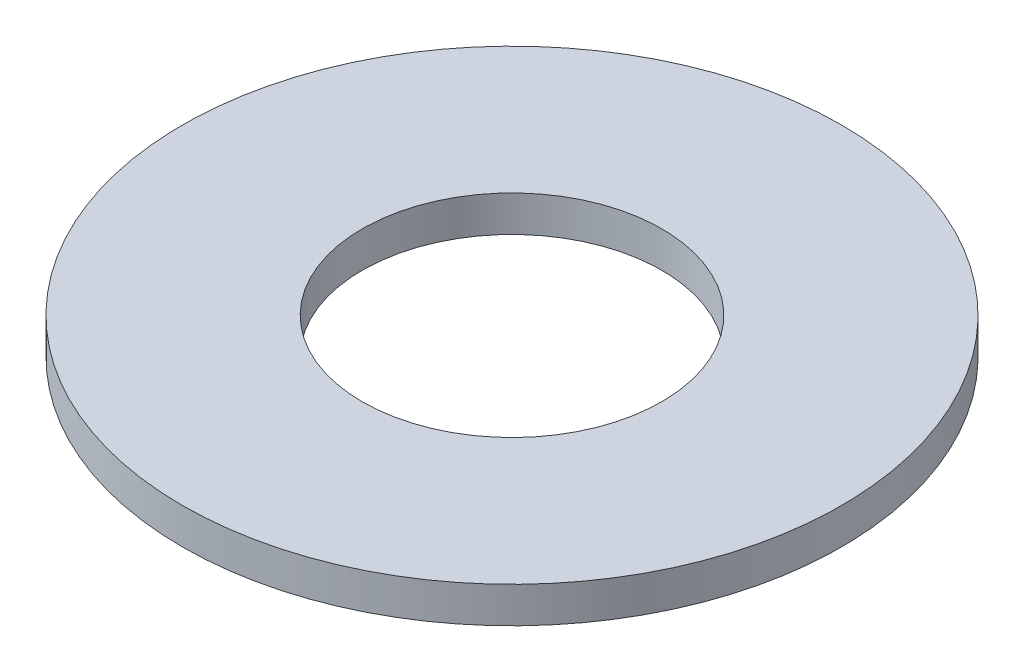
ISO-10303-21;
HEADER;
FILE_DESCRIPTION(('STEP AP214'),'2;1');
FILE_NAME('part.step','',(''),(''),'','','');
FILE_SCHEMA(('AUTOMOTIVE_DESIGN { 1 0 10303 214 1 1 1 1 }'));
ENDSEC;
DATA;
#1=APPLICATION_CONTEXT('core data for automotive mechanical design processes');
#2=APPLICATION_PROTOCOL_DEFINITION('international standard','automotive_design',2000,#1);
#3=PRODUCT_CONTEXT('',#1,'mechanical');
#4=PRODUCT('Part','Part','',(#3));
#5=PRODUCT_RELATED_PRODUCT_CATEGORY('part','',(#4));
#6=PRODUCT_DEFINITION_FORMATION('','',#4);
#7=PRODUCT_DEFINITION_CONTEXT('part definition',#1,'design');
#8=PRODUCT_DEFINITION('design','',#6,#7);
#9=PRODUCT_DEFINITION_SHAPE('','',#8);
#10=(LENGTH_UNIT() NAMED_UNIT(*) SI_UNIT(.MILLI.,.METRE.));
#11=(NAMED_UNIT(*) PLANE_ANGLE_UNIT() SI_UNIT($,.RADIAN.));
#12=(NAMED_UNIT(*) SI_UNIT($,.STERADIAN.) SOLID_ANGLE_UNIT());
#13=UNCERTAINTY_MEASURE_WITH_UNIT(LENGTH_MEASURE(1.E-05),#10,'distance_accuracy_value','');
#14=(GEOMETRIC_REPRESENTATION_CONTEXT(3) GLOBAL_UNCERTAINTY_ASSIGNED_CONTEXT((#13)) GLOBAL_UNIT_ASSIGNED_CONTEXT((#10,
#11,#12)) REPRESENTATION_CONTEXT('',''));
#15=CARTESIAN_POINT('',(0.,0.,0.));
#16=DIRECTION('',(0.,0.,1.));
#17=DIRECTION('',(1.,0.,0.));
#18=AXIS2_PLACEMENT_3D('',#15,#16,#17);
#19=CARTESIAN_POINT('',(0.,9.,0.));
#20=DIRECTION('',(0.,-1.,0.));
#21=DIRECTION('',(0.,0.,-1.));
#22=AXIS2_PLACEMENT_3D('',#19,#20,#21);
#23=CYLINDRICAL_SURFACE('',#22,82.5);
#24=CARTESIAN_POINT('',(0.,9.,0.));
#25=DIRECTION('',(0.,1.,0.));
#26=DIRECTION('',(0.,0.,1.));
#27=AXIS2_PLACEMENT_3D('',#24,#25,#26);
#28=CIRCLE('',#27,82.5);
#29=CARTESIAN_POINT('',(0.,9.,82.5));
#30=VERTEX_POINT('',#29);
#31=EDGE_CURVE('E10',#30,#30,#28,.T.);
#32=ORIENTED_EDGE('',*,*,#31,.F.);
#33=EDGE_LOOP('',(#32));
#34=FACE_BOUND('',#33,.T.);
#35=CARTESIAN_POINT('',(0.,0.,0.));
#36=DIRECTION('',(0.,1.,0.));
#37=DIRECTION('',(0.,0.,1.));
#38=AXIS2_PLACEMENT_3D('',#35,#36,#37);
#39=CIRCLE('',#38,82.5);
#40=CARTESIAN_POINT('',(0.,0.,82.5));
#41=VERTEX_POINT('',#40);
#42=EDGE_CURVE('E37',#41,#41,#39,.T.);
#43=ORIENTED_EDGE('',*,*,#42,.T.);
#44=EDGE_LOOP('',(#43));
#45=FACE_BOUND('',#44,.T.);
#46=ADVANCED_FACE('F40',(#34,#45),#23,.T.);
#47=CARTESIAN_POINT('',(0.,9.,0.));
#48=DIRECTION('',(0.,1.,0.));
#49=DIRECTION('',(0.,0.,1.));
#50=AXIS2_PLACEMENT_3D('',#47,#48,#49);
#51=PLANE('',#50);
#52=CARTESIAN_POINT('',(0.,9.,0.));
#53=DIRECTION('',(0.,1.,0.));
#54=DIRECTION('',(0.,0.,1.));
#55=AXIS2_PLACEMENT_3D('',#52,#53,#54);
#56=CIRCLE('',#55,37.5);
#57=CARTESIAN_POINT('',(0.,9.,37.5));
#58=VERTEX_POINT('',#57);
#59=EDGE_CURVE('E50',#58,#58,#56,.T.);
#60=ORIENTED_EDGE('',*,*,#59,.F.);
#61=EDGE_LOOP('',(#60));
#62=FACE_BOUND('',#61,.T.);
#63=ORIENTED_EDGE('',*,*,#31,.T.);
#64=EDGE_LOOP('',(#63));
#65=FACE_BOUND('',#64,.T.);
#66=ADVANCED_FACE('F59',(#62,#65),#51,.T.);
#67=CARTESIAN_POINT('',(0.,0.,0.));
#68=DIRECTION('',(0.,1.,0.));
#69=DIRECTION('',(0.,0.,1.));
#70=AXIS2_PLACEMENT_3D('',#67,#68,#69);
#71=PLANE('',#70);
#72=CARTESIAN_POINT('',(0.,0.,0.));
#73=DIRECTION('',(0.,1.,0.));
#74=DIRECTION('',(0.,0.,1.));
#75=AXIS2_PLACEMENT_3D('',#72,#73,#74);
#76=CIRCLE('',#75,37.5);
#77=CARTESIAN_POINT('',(0.,0.,37.5));
#78=VERTEX_POINT('',#77);
#79=EDGE_CURVE('E47',#78,#78,#76,.T.);
#80=ORIENTED_EDGE('',*,*,#79,.T.);
#81=EDGE_LOOP('',(#80));
#82=FACE_BOUND('',#81,.T.);
#83=ORIENTED_EDGE('',*,*,#42,.F.);
#84=EDGE_LOOP('',(#83));
#85=FACE_BOUND('',#84,.T.);
#86=ADVANCED_FACE('F58',(#82,#85),#71,.F.);
#87=CARTESIAN_POINT('',(0.,9.,0.));
#88=DIRECTION('',(0.,-1.,0.));
#89=DIRECTION('',(0.,0.,-1.));
#90=AXIS2_PLACEMENT_3D('',#87,#88,#89);
#91=CYLINDRICAL_SURFACE('',#90,37.5);
#92=ORIENTED_EDGE('',*,*,#59,.T.);
#93=EDGE_LOOP('',(#92));
#94=FACE_BOUND('',#93,.T.);
#95=ORIENTED_EDGE('',*,*,#79,.F.);
#96=EDGE_LOOP('',(#95));
#97=FACE_BOUND('',#96,.T.);
#98=ADVANCED_FACE('F54',(#94,#97),#91,.F.);
#99=CLOSED_SHELL('',(#46,#66,#86,#98));
#100=MANIFOLD_SOLID_BREP('B2',#99);
#101=ADVANCED_BREP_SHAPE_REPRESENTATION('',(#18,#100),#14);
#102=SHAPE_DEFINITION_REPRESENTATION(#9,#101);
ENDSEC;
END-ISO-10303-21;
